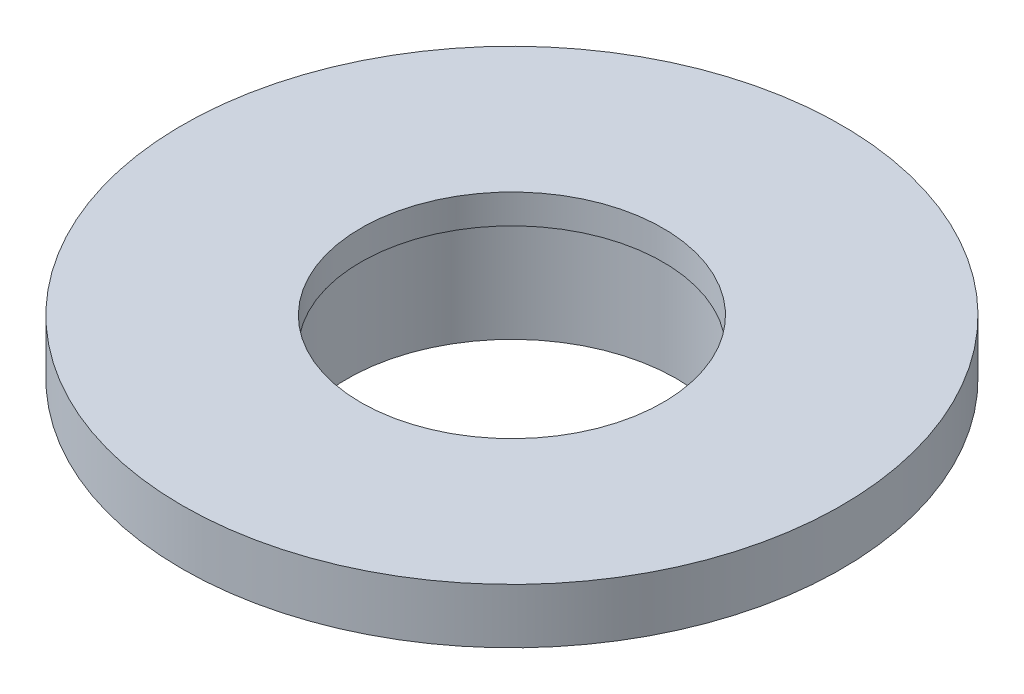
ISO-10303-21;
HEADER;
FILE_DESCRIPTION(('STEP AP214'),'2;1');
FILE_NAME('part.step','',(''),(''),'','','');
FILE_SCHEMA(('AUTOMOTIVE_DESIGN { 1 0 10303 214 1 1 1 1 }'));
ENDSEC;
DATA;
#1=APPLICATION_CONTEXT('core data for automotive mechanical design processes');
#2=APPLICATION_PROTOCOL_DEFINITION('international standard','automotive_design',2000,#1);
#3=PRODUCT_CONTEXT('',#1,'mechanical');
#4=PRODUCT('Part','Part','',(#3));
#5=PRODUCT_RELATED_PRODUCT_CATEGORY('part','',(#4));
#6=PRODUCT_DEFINITION_FORMATION('','',#4);
#7=PRODUCT_DEFINITION_CONTEXT('part definition',#1,'design');
#8=PRODUCT_DEFINITION('design','',#6,#7);
#9=PRODUCT_DEFINITION_SHAPE('','',#8);
#10=(LENGTH_UNIT() NAMED_UNIT(*) SI_UNIT(.MILLI.,.METRE.));
#11=(NAMED_UNIT(*) PLANE_ANGLE_UNIT() SI_UNIT($,.RADIAN.));
#12=(NAMED_UNIT(*) SI_UNIT($,.STERADIAN.) SOLID_ANGLE_UNIT());
#13=UNCERTAINTY_MEASURE_WITH_UNIT(LENGTH_MEASURE(1.E-05),#10,'distance_accuracy_value','');
#14=(GEOMETRIC_REPRESENTATION_CONTEXT(3) GLOBAL_UNCERTAINTY_ASSIGNED_CONTEXT((#13)) GLOBAL_UNIT_ASSIGNED_CONTEXT((#10,
#11,#12)) REPRESENTATION_CONTEXT('',''));
#15=CARTESIAN_POINT('',(0.,0.,0.));
#16=DIRECTION('',(0.,0.,1.));
#17=DIRECTION('',(1.,0.,0.));
#18=AXIS2_PLACEMENT_3D('',#15,#16,#17);
#19=CARTESIAN_POINT('',(7.00000000000001,-4.,0.));
#20=DIRECTION('',(0.,1.,0.));
#21=DIRECTION('',(0.,0.,1.));
#22=AXIS2_PLACEMENT_3D('',#19,#20,#21);
#23=PLANE('',#22);
#24=CARTESIAN_POINT('',(0.,-4.,0.));
#25=DIRECTION('',(0.,1.,0.));
#26=DIRECTION('',(0.,0.,1.));
#27=AXIS2_PLACEMENT_3D('',#24,#25,#26);
#28=CIRCLE('',#27,6.);
#29=CARTESIAN_POINT('',(0.,-4.,6.));
#30=VERTEX_POINT('',#29);
#31=EDGE_CURVE('E18',#30,#30,#28,.T.);
#32=ORIENTED_EDGE('',*,*,#31,.T.);
#33=EDGE_LOOP('',(#32));
#34=FACE_BOUND('',#33,.T.);
#35=CARTESIAN_POINT('',(0.,-4.,0.));
#36=DIRECTION('',(0.,1.,0.));
#37=DIRECTION('',(0.,0.,1.));
#38=AXIS2_PLACEMENT_3D('',#35,#36,#37);
#39=CIRCLE('',#38,7.00000000000001);
#40=CARTESIAN_POINT('',(0.,-4.,7.00000000000001));
#41=VERTEX_POINT('',#40);
#42=EDGE_CURVE('E40',#41,#41,#39,.T.);
#43=ORIENTED_EDGE('',*,*,#42,.F.);
#44=EDGE_LOOP('',(#43));
#45=FACE_BOUND('',#44,.T.);
#46=ADVANCED_FACE('F15',(#34,#45),#23,.F.);
#47=CARTESIAN_POINT('',(0.,42.0091097728689,0.));
#48=DIRECTION('',(0.,1.,0.));
#49=DIRECTION('',(0.,0.,1.));
#50=AXIS2_PLACEMENT_3D('',#47,#48,#49);
#51=CYLINDRICAL_SURFACE('',#50,6.);
#52=ORIENTED_EDGE('',*,*,#31,.F.);
#53=EDGE_LOOP('',(#52));
#54=FACE_BOUND('',#53,.T.);
#55=CARTESIAN_POINT('',(0.,-0.0673075568906473,0.));
#56=DIRECTION('',(0.,1.,0.));
#57=DIRECTION('',(0.,0.,1.));
#58=AXIS2_PLACEMENT_3D('',#55,#56,#57);
#59=CIRCLE('',#58,6.);
#60=CARTESIAN_POINT('',(0.,-0.0673075568906473,6.));
#61=VERTEX_POINT('',#60);
#62=EDGE_CURVE('E38',#61,#61,#59,.T.);
#63=ORIENTED_EDGE('',*,*,#62,.T.);
#64=EDGE_LOOP('',(#63));
#65=FACE_BOUND('',#64,.T.);
#66=ADVANCED_FACE('F49',(#54,#65),#51,.F.);
#67=CARTESIAN_POINT('',(0.,42.0091097728689,0.));
#68=DIRECTION('',(0.,1.,0.));
#69=DIRECTION('',(0.,0.,1.));
#70=AXIS2_PLACEMENT_3D('',#67,#68,#69);
#71=CYLINDRICAL_SURFACE('',#70,7.00000000000001);
#72=CARTESIAN_POINT('',(0.,-1.,0.));
#73=DIRECTION('',(0.,1.,0.));
#74=DIRECTION('',(0.,0.,1.));
#75=AXIS2_PLACEMENT_3D('',#72,#73,#74);
#76=CIRCLE('',#75,7.00000000000001);
#77=CARTESIAN_POINT('',(0.,-1.,7.00000000000001));
#78=VERTEX_POINT('',#77);
#79=EDGE_CURVE('E35',#78,#78,#76,.F.);
#80=ORIENTED_EDGE('',*,*,#79,.T.);
#81=EDGE_LOOP('',(#80));
#82=FACE_BOUND('',#81,.T.);
#83=ORIENTED_EDGE('',*,*,#42,.T.);
#84=EDGE_LOOP('',(#83));
#85=FACE_BOUND('',#84,.T.);
#86=ADVANCED_FACE('F52',(#82,#85),#71,.T.);
#87=CARTESIAN_POINT('',(5.50000000000001,-0.0673075568906443,0.));
#88=DIRECTION('',(0.,1.,0.));
#89=DIRECTION('',(0.,0.,1.));
#90=AXIS2_PLACEMENT_3D('',#87,#88,#89);
#91=PLANE('',#90);
#92=CARTESIAN_POINT('',(0.,-0.0673075568906473,0.));
#93=DIRECTION('',(0.,1.,0.));
#94=DIRECTION('',(0.,0.,1.));
#95=AXIS2_PLACEMENT_3D('',#92,#93,#94);
#96=CIRCLE('',#95,5.50000000000001);
#97=CARTESIAN_POINT('',(0.,-0.0673075568906473,5.50000000000001));
#98=VERTEX_POINT('',#97);
#99=EDGE_CURVE('E32',#98,#98,#96,.T.);
#100=ORIENTED_EDGE('',*,*,#99,.T.);
#101=EDGE_LOOP('',(#100));
#102=FACE_BOUND('',#101,.T.);
#103=ORIENTED_EDGE('',*,*,#62,.F.);
#104=EDGE_LOOP('',(#103));
#105=FACE_BOUND('',#104,.T.);
#106=ADVANCED_FACE('F55',(#102,#105),#91,.F.);
#107=CARTESIAN_POINT('',(12.,-1.,0.));
#108=DIRECTION('',(0.,1.,0.));
#109=DIRECTION('',(0.,0.,1.));
#110=AXIS2_PLACEMENT_3D('',#107,#108,#109);
#111=PLANE('',#110);
#112=ORIENTED_EDGE('',*,*,#79,.F.);
#113=EDGE_LOOP('',(#112));
#114=FACE_BOUND('',#113,.T.);
#115=CARTESIAN_POINT('',(0.,-1.,0.));
#116=DIRECTION('',(0.,1.,0.));
#117=DIRECTION('',(0.,0.,1.));
#118=AXIS2_PLACEMENT_3D('',#115,#116,#117);
#119=CIRCLE('',#118,12.);
#120=CARTESIAN_POINT('',(0.,-1.,12.));
#121=VERTEX_POINT('',#120);
#122=EDGE_CURVE('E27',#121,#121,#119,.T.);
#123=ORIENTED_EDGE('',*,*,#122,.F.);
#124=EDGE_LOOP('',(#123));
#125=FACE_BOUND('',#124,.T.);
#126=ADVANCED_FACE('F57',(#114,#125),#111,.F.);
#127=CARTESIAN_POINT('',(0.,42.0091097728689,0.));
#128=DIRECTION('',(0.,1.,0.));
#129=DIRECTION('',(0.,0.,1.));
#130=AXIS2_PLACEMENT_3D('',#127,#128,#129);
#131=CYLINDRICAL_SURFACE('',#130,5.50000000000001);
#132=ORIENTED_EDGE('',*,*,#99,.F.);
#133=EDGE_LOOP('',(#132));
#134=FACE_BOUND('',#133,.T.);
#135=CARTESIAN_POINT('',(0.,1.,0.));
#136=DIRECTION('',(0.,1.,0.));
#137=DIRECTION('',(0.,0.,1.));
#138=AXIS2_PLACEMENT_3D('',#135,#136,#137);
#139=CIRCLE('',#138,5.50000000000001);
#140=CARTESIAN_POINT('',(0.,1.,5.50000000000001));
#141=VERTEX_POINT('',#140);
#142=EDGE_CURVE('E22',#141,#141,#139,.T.);
#143=ORIENTED_EDGE('',*,*,#142,.T.);
#144=EDGE_LOOP('',(#143));
#145=FACE_BOUND('',#144,.T.);
#146=ADVANCED_FACE('F65',(#134,#145),#131,.F.);
#147=CARTESIAN_POINT('',(0.,42.0091097728689,0.));
#148=DIRECTION('',(0.,1.,0.));
#149=DIRECTION('',(0.,0.,1.));
#150=AXIS2_PLACEMENT_3D('',#147,#148,#149);
#151=CYLINDRICAL_SURFACE('',#150,12.);
#152=CARTESIAN_POINT('',(0.,1.,0.));
#153=DIRECTION('',(0.,1.,0.));
#154=DIRECTION('',(0.,0.,1.));
#155=AXIS2_PLACEMENT_3D('',#152,#153,#154);
#156=CIRCLE('',#155,12.);
#157=CARTESIAN_POINT('',(0.,1.,12.));
#158=VERTEX_POINT('',#157);
#159=EDGE_CURVE('E10',#158,#158,#156,.F.);
#160=ORIENTED_EDGE('',*,*,#159,.T.);
#161=EDGE_LOOP('',(#160));
#162=FACE_BOUND('',#161,.T.);
#163=ORIENTED_EDGE('',*,*,#122,.T.);
#164=EDGE_LOOP('',(#163));
#165=FACE_BOUND('',#164,.T.);
#166=ADVANCED_FACE('F72',(#162,#165),#151,.T.);
#167=CARTESIAN_POINT('',(12.,1.,0.));
#168=DIRECTION('',(0.,-1.,0.));
#169=DIRECTION('',(0.,0.,-1.));
#170=AXIS2_PLACEMENT_3D('',#167,#168,#169);
#171=PLANE('',#170);
#172=ORIENTED_EDGE('',*,*,#159,.F.);
#173=EDGE_LOOP('',(#172));
#174=FACE_BOUND('',#173,.T.);
#175=ORIENTED_EDGE('',*,*,#142,.F.);
#176=EDGE_LOOP('',(#175));
#177=FACE_BOUND('',#176,.T.);
#178=ADVANCED_FACE('F70',(#174,#177),#171,.F.);
#179=CLOSED_SHELL('',(#46,#66,#86,#106,#126,#146,#166,#178));
#180=MANIFOLD_SOLID_BREP('B1',#179);
#181=ADVANCED_BREP_SHAPE_REPRESENTATION('',(#18,#180),#14);
#182=SHAPE_DEFINITION_REPRESENTATION(#9,#181);
ENDSEC;
END-ISO-10303-21;
